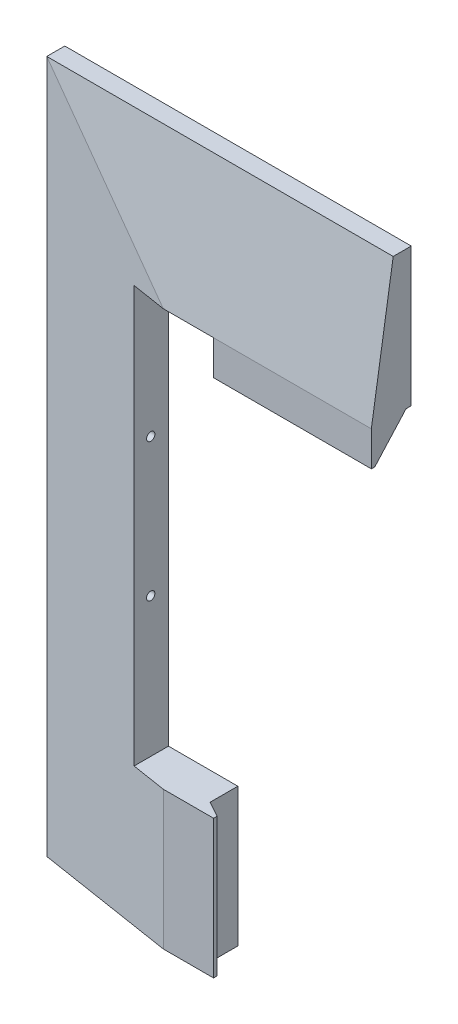
ISO-10303-21;
HEADER;
FILE_DESCRIPTION(('STEP AP214'),'2;1');
FILE_NAME('part.step','',(''),(''),'','','');
FILE_SCHEMA(('AUTOMOTIVE_DESIGN { 1 0 10303 214 1 1 1 1 }'));
ENDSEC;
DATA;
#1=APPLICATION_CONTEXT('core data for automotive mechanical design processes');
#2=APPLICATION_PROTOCOL_DEFINITION('international standard','automotive_design',2000,#1);
#3=PRODUCT_CONTEXT('',#1,'mechanical');
#4=PRODUCT('Part','Part','',(#3));
#5=PRODUCT_RELATED_PRODUCT_CATEGORY('part','',(#4));
#6=PRODUCT_DEFINITION_FORMATION('','',#4);
#7=PRODUCT_DEFINITION_CONTEXT('part definition',#1,'design');
#8=PRODUCT_DEFINITION('design','',#6,#7);
#9=PRODUCT_DEFINITION_SHAPE('','',#8);
#10=(LENGTH_UNIT() NAMED_UNIT(*) SI_UNIT(.MILLI.,.METRE.));
#11=(NAMED_UNIT(*) PLANE_ANGLE_UNIT() SI_UNIT($,.RADIAN.));
#12=(NAMED_UNIT(*) SI_UNIT($,.STERADIAN.) SOLID_ANGLE_UNIT());
#13=UNCERTAINTY_MEASURE_WITH_UNIT(LENGTH_MEASURE(1.E-05),#10,'distance_accuracy_value','');
#14=(GEOMETRIC_REPRESENTATION_CONTEXT(3) GLOBAL_UNCERTAINTY_ASSIGNED_CONTEXT((#13)) GLOBAL_UNIT_ASSIGNED_CONTEXT((#10,
#11,#12)) REPRESENTATION_CONTEXT('',''));
#15=CARTESIAN_POINT('',(0.,0.,0.));
#16=DIRECTION('',(0.,0.,1.));
#17=DIRECTION('',(1.,0.,0.));
#18=AXIS2_PLACEMENT_3D('',#15,#16,#17);
#19=CARTESIAN_POINT('',(18.5428324180509,83.245366469038,5.2));
#20=DIRECTION('',(-1.,0.,0.));
#21=DIRECTION('',(0.,1.,0.));
#22=AXIS2_PLACEMENT_3D('',#19,#20,#21);
#23=PLANE('',#22);
#24=DIRECTION('',(0.,0.,-1.));
#25=VECTOR('',#24,1.);
#26=CARTESIAN_POINT('',(18.5428324180508,243.145366469038,5.2));
#27=LINE('',#26,#25);
#28=CARTESIAN_POINT('',(18.5428324180508,243.145366469038,1.5));
#29=VERTEX_POINT('',#28);
#30=CARTESIAN_POINT('',(18.5428324180508,243.145366469038,0.));
#31=VERTEX_POINT('',#30);
#32=EDGE_CURVE('E475',#29,#31,#27,.T.);
#33=ORIENTED_EDGE('',*,*,#32,.T.);
#34=DIRECTION('',(0.,-1.,0.));
#35=VECTOR('',#34,1.);
#36=CARTESIAN_POINT('',(18.5428324180508,243.145366469038,0.));
#37=LINE('',#36,#35);
#38=CARTESIAN_POINT('',(18.5428324180508,283.045366469038,0.));
#39=VERTEX_POINT('',#38);
#40=EDGE_CURVE('E563',#39,#31,#37,.T.);
#41=ORIENTED_EDGE('',*,*,#40,.F.);
#42=DIRECTION('',(0.,0.,-1.));
#43=VECTOR('',#42,1.);
#44=CARTESIAN_POINT('',(18.5428324180508,283.045366469038,5.2));
#45=LINE('',#44,#43);
#46=CARTESIAN_POINT('',(18.5428324180508,283.045366469038,5.2));
#47=VERTEX_POINT('',#46);
#48=EDGE_CURVE('E479',#47,#39,#45,.T.);
#49=ORIENTED_EDGE('',*,*,#48,.F.);
#50=DIRECTION('',(0.,0.987762965329069,-0.155962573473011));
#51=VECTOR('',#50,1.);
#52=CARTESIAN_POINT('',(18.5428324180508,243.145366469038,11.5));
#53=LINE('',#52,#51);
#54=CARTESIAN_POINT('',(18.5428324180508,243.145366469038,11.5));
#55=VERTEX_POINT('',#54);
#56=EDGE_CURVE('E629',#55,#47,#53,.T.);
#57=ORIENTED_EDGE('',*,*,#56,.F.);
#58=DIRECTION('',(0.,1.,0.));
#59=VECTOR('',#58,1.);
#60=CARTESIAN_POINT('',(18.5428324180508,233.145366469038,11.5));
#61=LINE('',#60,#59);
#62=CARTESIAN_POINT('',(18.5428324180508,233.145366469038,11.5));
#63=VERTEX_POINT('',#62);
#64=EDGE_CURVE('E271',#63,#55,#61,.T.);
#65=ORIENTED_EDGE('',*,*,#64,.F.);
#66=DIRECTION('',(0.,0.,1.));
#67=VECTOR('',#66,1.);
#68=CARTESIAN_POINT('',(18.5428324180508,233.145366469038,10.5));
#69=LINE('',#68,#67);
#70=CARTESIAN_POINT('',(18.5428324180508,233.145366469038,10.5));
#71=VERTEX_POINT('',#70);
#72=EDGE_CURVE('E270',#71,#63,#69,.T.);
#73=ORIENTED_EDGE('',*,*,#72,.F.);
#74=DIRECTION('',(0.,-0.743294146247166,0.66896473162245));
#75=VECTOR('',#74,1.);
#76=CARTESIAN_POINT('',(18.5428324180508,243.145366469038,1.5));
#77=LINE('',#76,#75);
#78=EDGE_CURVE('E252',#29,#71,#77,.T.);
#79=ORIENTED_EDGE('',*,*,#78,.F.);
#80=EDGE_LOOP('',(#33,#41,#49,#57,#65,#73,#79));
#81=FACE_BOUND('',#80,.T.);
#82=ADVANCED_FACE('F60',(#81),#23,.F.);
#83=CARTESIAN_POINT('',(0.,166.490732938076,11.5));
#84=DIRECTION('',(0.,0.,-1.));
#85=DIRECTION('',(-1.,0.,0.));
#86=AXIS2_PLACEMENT_3D('',#83,#84,#85);
#87=PLANE('',#86);
#88=DIRECTION('',(-1.,0.,0.));
#89=VECTOR('',#88,1.);
#90=CARTESIAN_POINT('',(0.,123.145366469038,11.5));
#91=LINE('',#90,#89);
#92=CARTESIAN_POINT('',(-26.9571675819491,123.145366469038,11.5));
#93=VERTEX_POINT('',#92);
#94=CARTESIAN_POINT('',(-41.4571675819491,123.145366469038,11.5));
#95=VERTEX_POINT('',#94);
#96=EDGE_CURVE('E397',#93,#95,#91,.T.);
#97=ORIENTED_EDGE('',*,*,#96,.T.);
#98=CARTESIAN_POINT('',(-41.4571675819491,83.245366469038,11.5));
#99=DIRECTION('',(0.,1.,0.));
#100=VECTOR('',#99,1.);
#101=LINE('',#98,#100);
#102=CARTESIAN_POINT('',(-41.4571675819491,83.245366469038,11.5));
#103=VERTEX_POINT('',#102);
#104=EDGE_CURVE('E625',#103,#95,#101,.T.);
#105=ORIENTED_EDGE('',*,*,#104,.F.);
#106=CARTESIAN_POINT('',(-31.4571675819491,83.245366469038,11.5));
#107=DIRECTION('',(-1.,0.,0.));
#108=VECTOR('',#107,1.);
#109=LINE('',#106,#108);
#110=CARTESIAN_POINT('',(-31.4571675819491,83.245366469038,11.5));
#111=VERTEX_POINT('',#110);
#112=EDGE_CURVE('E461',#111,#103,#109,.T.);
#113=ORIENTED_EDGE('',*,*,#112,.F.);
#114=DIRECTION('',(1.,0.,0.));
#115=VECTOR('',#114,1.);
#116=CARTESIAN_POINT('',(-31.4571675819491,83.245366469038,11.5));
#117=LINE('',#116,#115);
#118=CARTESIAN_POINT('',(-26.9571675819491,83.245366469038,11.5));
#119=VERTEX_POINT('',#118);
#120=EDGE_CURVE('E276',#111,#119,#117,.T.);
#121=ORIENTED_EDGE('',*,*,#120,.T.);
#122=DIRECTION('',(0.,-1.,0.));
#123=VECTOR('',#122,1.);
#124=CARTESIAN_POINT('',(-26.9571675819491,123.145366469038,11.5));
#125=LINE('',#124,#123);
#126=EDGE_CURVE('E289',#93,#119,#125,.T.);
#127=ORIENTED_EDGE('',*,*,#126,.F.);
#128=EDGE_LOOP('',(#97,#105,#113,#121,#127));
#129=FACE_BOUND('',#128,.T.);
#130=ADVANCED_FACE('F535',(#129),#87,.F.);
#131=CARTESIAN_POINT('',(-2.78003921145283,166.490732938076,17.6069150058678));
#132=DIRECTION('',(-0.155962573473011,0.,0.987762965329069));
#133=DIRECTION('',(0.987762965329069,0.,0.155962573473011));
#134=AXIS2_PLACEMENT_3D('',#131,#132,#133);
#135=PLANE('',#134);
#136=DIRECTION('',(0.,1.,0.));
#137=VECTOR('',#136,1.);
#138=CARTESIAN_POINT('',(-51.4571675819492,166.490732938076,9.92105263157894));
#139=LINE('',#138,#137);
#140=CARTESIAN_POINT('',(-51.4571675819492,123.145366469038,9.92105263157894));
#141=VERTEX_POINT('',#140);
#142=CARTESIAN_POINT('',(-51.4571675819492,243.145366469038,9.92105263157894));
#143=VERTEX_POINT('',#142);
#144=EDGE_CURVE('E495',#141,#143,#139,.T.);
#145=ORIENTED_EDGE('',*,*,#144,.T.);
#146=DIRECTION('',(-0.987762965329069,0.,-0.155962573473011));
#147=VECTOR('',#146,1.);
#148=CARTESIAN_POINT('',(-2.78003921145283,243.145366469038,17.6069150058678));
#149=LINE('',#148,#147);
#150=CARTESIAN_POINT('',(-41.4571675819491,243.145366469038,11.5));
#151=VERTEX_POINT('',#150);
#152=EDGE_CURVE('E606',#151,#143,#149,.T.);
#153=ORIENTED_EDGE('',*,*,#152,.F.);
#154=DIRECTION('',(-0.702740385382544,0.702740385382543,-0.110959008218296));
#155=VECTOR('',#154,1.);
#156=CARTESIAN_POINT('',(-41.4571675819491,243.145366469038,11.5));
#157=LINE('',#156,#155);
#158=CARTESIAN_POINT('',(-81.3571675819492,283.045366469038,5.2));
#159=VERTEX_POINT('',#158);
#160=EDGE_CURVE('E575',#151,#159,#157,.T.);
#161=ORIENTED_EDGE('',*,*,#160,.T.);
#162=DIRECTION('',(0.,-1.,0.));
#163=VECTOR('',#162,1.);
#164=CARTESIAN_POINT('',(-81.3571675819492,166.490732938076,5.2));
#165=LINE('',#164,#163);
#166=CARTESIAN_POINT('',(-81.3571675819492,83.245366469038,5.2));
#167=VERTEX_POINT('',#166);
#168=EDGE_CURVE('E506',#167,#159,#165,.F.);
#169=ORIENTED_EDGE('',*,*,#168,.F.);
#170=DIRECTION('',(-0.987762965329069,0.,-0.155962573473011));
#171=VECTOR('',#170,1.);
#172=CARTESIAN_POINT('',(-41.4571675819491,83.245366469038,11.5));
#173=LINE('',#172,#171);
#174=EDGE_CURVE('E571',#103,#167,#173,.T.);
#175=ORIENTED_EDGE('',*,*,#174,.F.);
#176=ORIENTED_EDGE('',*,*,#104,.T.);
#177=DIRECTION('',(0.987762965329069,0.,0.155962573473011));
#178=VECTOR('',#177,1.);
#179=CARTESIAN_POINT('',(-2.78003921145283,123.145366469038,17.6069150058678));
#180=LINE('',#179,#178);
#181=EDGE_CURVE('E640',#141,#95,#180,.T.);
#182=ORIENTED_EDGE('',*,*,#181,.F.);
#183=EDGE_LOOP('',(#145,#153,#161,#169,#175,#176,#182));
#184=FACE_BOUND('',#183,.T.);
#185=ADVANCED_FACE('F553',(#184),#135,.T.);
#186=CARTESIAN_POINT('',(-81.3571675819492,83.245366469038,5.2));
#187=DIRECTION('',(1.,0.,0.));
#188=DIRECTION('',(0.,-1.,0.));
#189=AXIS2_PLACEMENT_3D('',#186,#187,#188);
#190=PLANE('',#189);
#191=DIRECTION('',(0.,1.,0.));
#192=VECTOR('',#191,1.);
#193=CARTESIAN_POINT('',(-81.3571675819492,83.245366469038,0.));
#194=LINE('',#193,#192);
#195=CARTESIAN_POINT('',(-81.3571675819492,83.245366469038,0.));
#196=VERTEX_POINT('',#195);
#197=CARTESIAN_POINT('',(-81.3571675819492,283.045366469038,0.));
#198=VERTEX_POINT('',#197);
#199=EDGE_CURVE('E564',#196,#198,#194,.T.);
#200=ORIENTED_EDGE('',*,*,#199,.F.);
#201=DIRECTION('',(0.,0.,-1.));
#202=VECTOR('',#201,1.);
#203=CARTESIAN_POINT('',(-81.3571675819492,83.245366469038,5.2));
#204=LINE('',#203,#202);
#205=EDGE_CURVE('E496',#167,#196,#204,.T.);
#206=ORIENTED_EDGE('',*,*,#205,.F.);
#207=ORIENTED_EDGE('',*,*,#168,.T.);
#208=DIRECTION('',(0.,0.,-1.));
#209=VECTOR('',#208,1.);
#210=CARTESIAN_POINT('',(-81.3571675819492,283.045366469038,5.2));
#211=LINE('',#210,#209);
#212=EDGE_CURVE('E489',#159,#198,#211,.T.);
#213=ORIENTED_EDGE('',*,*,#212,.T.);
#214=EDGE_LOOP('',(#200,#206,#207,#213));
#215=FACE_BOUND('',#214,.T.);
#216=ADVANCED_FACE('F62',(#215),#190,.F.);
#217=CARTESIAN_POINT('',(-81.3571675819492,283.045366469038,5.2));
#218=DIRECTION('',(0.,-1.,0.));
#219=DIRECTION('',(-1.,0.,0.));
#220=AXIS2_PLACEMENT_3D('',#217,#218,#219);
#221=PLANE('',#220);
#222=DIRECTION('',(1.,0.,0.));
#223=VECTOR('',#222,1.);
#224=CARTESIAN_POINT('',(-81.3571675819492,283.045366469038,0.));
#225=LINE('',#224,#223);
#226=EDGE_CURVE('E556',#198,#39,#225,.T.);
#227=ORIENTED_EDGE('',*,*,#226,.F.);
#228=ORIENTED_EDGE('',*,*,#212,.F.);
#229=DIRECTION('',(1.,0.,0.));
#230=VECTOR('',#229,1.);
#231=CARTESIAN_POINT('',(0.,283.045366469038,5.2));
#232=LINE('',#231,#230);
#233=EDGE_CURVE('E501',#159,#47,#232,.T.);
#234=ORIENTED_EDGE('',*,*,#233,.T.);
#235=ORIENTED_EDGE('',*,*,#48,.T.);
#236=EDGE_LOOP('',(#227,#228,#234,#235));
#237=FACE_BOUND('',#236,.T.);
#238=ADVANCED_FACE('F546',(#237),#221,.F.);
#239=CARTESIAN_POINT('',(-51.4571675819492,243.145366469038,5.2));
#240=DIRECTION('',(0.,1.,0.));
#241=DIRECTION('',(1.,0.,0.));
#242=AXIS2_PLACEMENT_3D('',#239,#240,#241);
#243=PLANE('',#242);
#244=DIRECTION('',(0.,0.,-1.));
#245=VECTOR('',#244,1.);
#246=CARTESIAN_POINT('',(-26.9571675819492,243.145366469038,11.5));
#247=LINE('',#246,#245);
#248=CARTESIAN_POINT('',(-26.9571675819492,243.145366469038,11.5));
#249=VERTEX_POINT('',#248);
#250=CARTESIAN_POINT('',(-26.9571675819492,243.145366469038,1.5));
#251=VERTEX_POINT('',#250);
#252=EDGE_CURVE('E247',#249,#251,#247,.T.);
#253=ORIENTED_EDGE('',*,*,#252,.F.);
#254=DIRECTION('',(1.,0.,0.));
#255=VECTOR('',#254,1.);
#256=CARTESIAN_POINT('',(-41.4571675819491,243.145366469038,11.5));
#257=LINE('',#256,#255);
#258=EDGE_CURVE('E610',#151,#249,#257,.T.);
#259=ORIENTED_EDGE('',*,*,#258,.F.);
#260=ORIENTED_EDGE('',*,*,#152,.T.);
#261=DIRECTION('',(0.,0.,-1.));
#262=VECTOR('',#261,1.);
#263=CARTESIAN_POINT('',(-51.4571675819492,243.145366469038,5.2));
#264=LINE('',#263,#262);
#265=CARTESIAN_POINT('',(-51.4571675819492,243.145366469038,0.));
#266=VERTEX_POINT('',#265);
#267=EDGE_CURVE('E480',#143,#266,#264,.T.);
#268=ORIENTED_EDGE('',*,*,#267,.T.);
#269=DIRECTION('',(-1.,0.,0.));
#270=VECTOR('',#269,1.);
#271=CARTESIAN_POINT('',(-51.4571675819492,243.145366469038,0.));
#272=LINE('',#271,#270);
#273=EDGE_CURVE('E585',#31,#266,#272,.T.);
#274=ORIENTED_EDGE('',*,*,#273,.F.);
#275=ORIENTED_EDGE('',*,*,#32,.F.);
#276=DIRECTION('',(1.,0.,0.));
#277=VECTOR('',#276,1.);
#278=CARTESIAN_POINT('',(-26.9571675819492,243.145366469038,1.5));
#279=LINE('',#278,#277);
#280=EDGE_CURVE('E82',#251,#29,#279,.T.);
#281=ORIENTED_EDGE('',*,*,#280,.F.);
#282=EDGE_LOOP('',(#253,#259,#260,#268,#274,#275,#281));
#283=FACE_BOUND('',#282,.T.);
#284=ADVANCED_FACE('F543',(#283),#243,.F.);
#285=CARTESIAN_POINT('',(-51.4571675819492,123.145366469038,5.2));
#286=DIRECTION('',(-1.,0.,0.));
#287=DIRECTION('',(0.,1.,0.));
#288=AXIS2_PLACEMENT_3D('',#285,#286,#287);
#289=PLANE('',#288);
#290=DIRECTION('',(0.,-1.,0.));
#291=VECTOR('',#290,1.);
#292=CARTESIAN_POINT('',(-51.4571675819492,123.145366469038,0.));
#293=LINE('',#292,#291);
#294=CARTESIAN_POINT('',(-51.4571675819492,123.145366469038,0.));
#295=VERTEX_POINT('',#294);
#296=EDGE_CURVE('E589',#266,#295,#293,.T.);
#297=ORIENTED_EDGE('',*,*,#296,.F.);
#298=ORIENTED_EDGE('',*,*,#267,.F.);
#299=ORIENTED_EDGE('',*,*,#144,.F.);
#300=DIRECTION('',(0.,0.,-1.));
#301=VECTOR('',#300,1.);
#302=CARTESIAN_POINT('',(-51.4571675819492,123.145366469038,5.2));
#303=LINE('',#302,#301);
#304=EDGE_CURVE('E500',#141,#295,#303,.T.);
#305=ORIENTED_EDGE('',*,*,#304,.T.);
#306=EDGE_LOOP('',(#297,#298,#299,#305));
#307=FACE_BOUND('',#306,.T.);
#308=CARTESIAN_POINT('',(-51.4571675819492,163.245366469038,5.12));
#309=DIRECTION('',(-1.,0.,0.));
#310=DIRECTION('',(0.,-1.,0.));
#311=AXIS2_PLACEMENT_3D('',#308,#309,#310);
#312=CIRCLE('',#311,1.2);
#313=CARTESIAN_POINT('',(-51.4571675819492,162.045366469038,5.12));
#314=VERTEX_POINT('',#313);
#315=EDGE_CURVE('E339',#314,#314,#312,.T.);
#316=ORIENTED_EDGE('',*,*,#315,.T.);
#317=EDGE_LOOP('',(#316));
#318=FACE_BOUND('',#317,.T.);
#319=CARTESIAN_POINT('',(-51.4571675819491,203.045366469038,5.12));
#320=DIRECTION('',(-1.,0.,0.));
#321=DIRECTION('',(0.,-1.,0.));
#322=AXIS2_PLACEMENT_3D('',#319,#320,#321);
#323=CIRCLE('',#322,1.2);
#324=CARTESIAN_POINT('',(-51.4571675819491,201.845366469038,5.12));
#325=VERTEX_POINT('',#324);
#326=EDGE_CURVE('E311',#325,#325,#323,.T.);
#327=ORIENTED_EDGE('',*,*,#326,.T.);
#328=EDGE_LOOP('',(#327));
#329=FACE_BOUND('',#328,.T.);
#330=ADVANCED_FACE('F539',(#307,#318,#329),#289,.F.);
#331=CARTESIAN_POINT('',(-51.4571675819492,123.145366469038,5.2));
#332=DIRECTION('',(0.,-1.,0.));
#333=DIRECTION('',(0.,0.,1.));
#334=AXIS2_PLACEMENT_3D('',#331,#332,#333);
#335=PLANE('',#334);
#336=DIRECTION('',(1.,0.,0.));
#337=VECTOR('',#336,1.);
#338=CARTESIAN_POINT('',(-51.4571675819492,123.145366469038,0.));
#339=LINE('',#338,#337);
#340=CARTESIAN_POINT('',(-31.4571675819491,123.145366469038,0.));
#341=VERTEX_POINT('',#340);
#342=EDGE_CURVE('E593',#295,#341,#339,.T.);
#343=ORIENTED_EDGE('',*,*,#342,.F.);
#344=ORIENTED_EDGE('',*,*,#304,.F.);
#345=ORIENTED_EDGE('',*,*,#181,.T.);
#346=ORIENTED_EDGE('',*,*,#96,.F.);
#347=DIRECTION('',(0.,0.,-1.));
#348=VECTOR('',#347,1.);
#349=CARTESIAN_POINT('',(-26.9571675819491,123.145366469038,11.5));
#350=LINE('',#349,#348);
#351=CARTESIAN_POINT('',(-26.9571675819491,123.145366469038,10.5));
#352=VERTEX_POINT('',#351);
#353=EDGE_CURVE('E280',#93,#352,#350,.T.);
#354=ORIENTED_EDGE('',*,*,#353,.T.);
#355=DIRECTION('',(-0.874157276121538,0.,-0.485642931178632));
#356=VECTOR('',#355,1.);
#357=CARTESIAN_POINT('',(-26.9571675819491,123.145366469038,10.5));
#358=LINE('',#357,#356);
#359=CARTESIAN_POINT('',(-31.4571675819491,123.145366469038,7.99999999999999));
#360=VERTEX_POINT('',#359);
#361=EDGE_CURVE('E284',#352,#360,#358,.T.);
#362=ORIENTED_EDGE('',*,*,#361,.T.);
#363=DIRECTION('',(0.,0.,1.));
#364=VECTOR('',#363,1.);
#365=CARTESIAN_POINT('',(-31.4571675819491,123.145366469038,-12.5));
#366=LINE('',#365,#364);
#367=EDGE_CURVE('E300',#341,#360,#366,.T.);
#368=ORIENTED_EDGE('',*,*,#367,.F.);
#369=EDGE_LOOP('',(#343,#344,#345,#346,#354,#362,#368));
#370=FACE_BOUND('',#369,.T.);
#371=ADVANCED_FACE('F530',(#370),#335,.F.);
#372=CARTESIAN_POINT('',(-81.3571675819492,83.245366469038,5.2));
#373=DIRECTION('',(0.,1.,0.));
#374=DIRECTION('',(1.,0.,0.));
#375=AXIS2_PLACEMENT_3D('',#372,#373,#374);
#376=PLANE('',#375);
#377=ORIENTED_EDGE('',*,*,#112,.T.);
#378=ORIENTED_EDGE('',*,*,#174,.T.);
#379=ORIENTED_EDGE('',*,*,#205,.T.);
#380=DIRECTION('',(-1.,0.,0.));
#381=VECTOR('',#380,1.);
#382=CARTESIAN_POINT('',(-81.3571675819492,83.245366469038,0.));
#383=LINE('',#382,#381);
#384=CARTESIAN_POINT('',(-31.4571675819491,83.245366469038,0.));
#385=VERTEX_POINT('',#384);
#386=EDGE_CURVE('E512',#385,#196,#383,.T.);
#387=ORIENTED_EDGE('',*,*,#386,.F.);
#388=DIRECTION('',(0.,0.,1.));
#389=VECTOR('',#388,1.);
#390=CARTESIAN_POINT('',(-31.4571675819491,83.245366469038,-12.5));
#391=LINE('',#390,#389);
#392=CARTESIAN_POINT('',(-31.4571675819491,83.245366469038,7.99999999999999));
#393=VERTEX_POINT('',#392);
#394=EDGE_CURVE('E310',#385,#393,#391,.T.);
#395=ORIENTED_EDGE('',*,*,#394,.T.);
#396=DIRECTION('',(-0.874157276121538,0.,-0.485642931178632));
#397=VECTOR('',#396,1.);
#398=CARTESIAN_POINT('',(-26.9571675819491,83.245366469038,10.5));
#399=LINE('',#398,#397);
#400=CARTESIAN_POINT('',(-26.9571675819491,83.245366469038,10.5));
#401=VERTEX_POINT('',#400);
#402=EDGE_CURVE('E285',#401,#393,#399,.T.);
#403=ORIENTED_EDGE('',*,*,#402,.F.);
#404=DIRECTION('',(0.,0.,-1.));
#405=VECTOR('',#404,1.);
#406=CARTESIAN_POINT('',(-26.9571675819491,83.245366469038,11.5));
#407=LINE('',#406,#405);
#408=EDGE_CURVE('E290',#119,#401,#407,.T.);
#409=ORIENTED_EDGE('',*,*,#408,.F.);
#410=ORIENTED_EDGE('',*,*,#120,.F.);
#411=EDGE_LOOP('',(#377,#378,#379,#387,#395,#403,#409,#410));
#412=FACE_BOUND('',#411,.T.);
#413=ADVANCED_FACE('F519',(#412),#376,.F.);
#414=CARTESIAN_POINT('',(0.,166.490732938076,0.));
#415=DIRECTION('',(0.,0.,1.));
#416=DIRECTION('',(1.,0.,0.));
#417=AXIS2_PLACEMENT_3D('',#414,#415,#416);
#418=PLANE('',#417);
#419=ORIENTED_EDGE('',*,*,#386,.T.);
#420=ORIENTED_EDGE('',*,*,#199,.T.);
#421=ORIENTED_EDGE('',*,*,#226,.T.);
#422=ORIENTED_EDGE('',*,*,#40,.T.);
#423=ORIENTED_EDGE('',*,*,#273,.T.);
#424=ORIENTED_EDGE('',*,*,#296,.T.);
#425=ORIENTED_EDGE('',*,*,#342,.T.);
#426=DIRECTION('',(0.,1.,0.));
#427=VECTOR('',#426,1.);
#428=CARTESIAN_POINT('',(-31.4571675819491,166.490732938076,0.));
#429=LINE('',#428,#427);
#430=EDGE_CURVE('E12',#385,#341,#429,.T.);
#431=ORIENTED_EDGE('',*,*,#430,.F.);
#432=EDGE_LOOP('',(#419,#420,#421,#422,#423,#424,#425,#431));
#433=FACE_BOUND('',#432,.T.);
#434=ADVANCED_FACE('F529',(#433),#418,.F.);
#435=CARTESIAN_POINT('',(0.,170.126926726667,23.0292273277428));
#436=DIRECTION('',(0.,0.155962573473011,0.987762965329069));
#437=DIRECTION('',(0.,0.987762965329069,-0.155962573473011));
#438=AXIS2_PLACEMENT_3D('',#435,#436,#437);
#439=PLANE('',#438);
#440=ORIENTED_EDGE('',*,*,#160,.F.);
#441=ORIENTED_EDGE('',*,*,#258,.T.);
#442=DIRECTION('',(1.,0.,0.));
#443=VECTOR('',#442,1.);
#444=CARTESIAN_POINT('',(-26.9571675819492,243.145366469038,11.5));
#445=LINE('',#444,#443);
#446=EDGE_CURVE('E262',#249,#55,#445,.T.);
#447=ORIENTED_EDGE('',*,*,#446,.T.);
#448=ORIENTED_EDGE('',*,*,#56,.T.);
#449=ORIENTED_EDGE('',*,*,#233,.F.);
#450=EDGE_LOOP('',(#440,#441,#447,#448,#449));
#451=FACE_BOUND('',#450,.T.);
#452=ADVANCED_FACE('F623',(#451),#439,.T.);
#453=CARTESIAN_POINT('',(-55.2571675819492,163.245366469038,5.12));
#454=DIRECTION('',(1.,0.,0.));
#455=DIRECTION('',(0.,-1.,0.));
#456=AXIS2_PLACEMENT_3D('',#453,#454,#455);
#457=PLANE('',#456);
#458=CARTESIAN_POINT('',(-55.2571675819492,163.245366469038,5.12));
#459=DIRECTION('',(-1.,0.,0.));
#460=DIRECTION('',(0.,-1.,0.));
#461=AXIS2_PLACEMENT_3D('',#458,#459,#460);
#462=CIRCLE('',#461,1.2);
#463=CARTESIAN_POINT('',(-55.2571675819492,162.045366469038,5.12));
#464=VERTEX_POINT('',#463);
#465=EDGE_CURVE('E340',#464,#464,#462,.T.);
#466=ORIENTED_EDGE('',*,*,#465,.F.);
#467=EDGE_LOOP('',(#466));
#468=FACE_BOUND('',#467,.T.);
#469=DIRECTION('',(0.,-0.5,-0.866025403784438));
#470=VECTOR('',#469,1.);
#471=CARTESIAN_POINT('',(-55.2571675819492,160.820495338442,5.12));
#472=LINE('',#471,#470);
#473=CARTESIAN_POINT('',(-55.2571675819492,162.03293090374,7.22));
#474=VERTEX_POINT('',#473);
#475=CARTESIAN_POINT('',(-55.2571675819492,160.820495338442,5.12));
#476=VERTEX_POINT('',#475);
#477=EDGE_CURVE('E636',#474,#476,#472,.T.);
#478=ORIENTED_EDGE('',*,*,#477,.F.);
#479=DIRECTION('',(0.,-1.,0.));
#480=VECTOR('',#479,1.);
#481=CARTESIAN_POINT('',(-55.2571675819492,162.03293090374,7.22));
#482=LINE('',#481,#480);
#483=CARTESIAN_POINT('',(-55.2571675819492,164.457802034336,7.22));
#484=VERTEX_POINT('',#483);
#485=EDGE_CURVE('E344',#484,#474,#482,.T.);
#486=ORIENTED_EDGE('',*,*,#485,.F.);
#487=DIRECTION('',(0.,-0.5,0.866025403784439));
#488=VECTOR('',#487,1.);
#489=CARTESIAN_POINT('',(-55.2571675819492,164.457802034336,7.22));
#490=LINE('',#489,#488);
#491=CARTESIAN_POINT('',(-55.2571675819492,165.670237599634,5.12));
#492=VERTEX_POINT('',#491);
#493=EDGE_CURVE('E351',#492,#484,#490,.T.);
#494=ORIENTED_EDGE('',*,*,#493,.F.);
#495=DIRECTION('',(0.,0.5,0.866025403784439));
#496=VECTOR('',#495,1.);
#497=CARTESIAN_POINT('',(-55.2571675819492,165.670237599634,5.12));
#498=LINE('',#497,#496);
#499=CARTESIAN_POINT('',(-55.2571675819492,164.457802034336,3.02));
#500=VERTEX_POINT('',#499);
#501=EDGE_CURVE('E355',#500,#492,#498,.T.);
#502=ORIENTED_EDGE('',*,*,#501,.F.);
#503=DIRECTION('',(0.,1.,0.));
#504=VECTOR('',#503,1.);
#505=CARTESIAN_POINT('',(-55.2571675819492,164.457802034336,3.02));
#506=LINE('',#505,#504);
#507=CARTESIAN_POINT('',(-55.2571675819492,162.03293090374,3.02));
#508=VERTEX_POINT('',#507);
#509=EDGE_CURVE('E359',#508,#500,#506,.T.);
#510=ORIENTED_EDGE('',*,*,#509,.F.);
#511=DIRECTION('',(0.,0.5,-0.866025403784439));
#512=VECTOR('',#511,1.);
#513=CARTESIAN_POINT('',(-55.2571675819492,162.03293090374,3.02));
#514=LINE('',#513,#512);
#515=EDGE_CURVE('E363',#476,#508,#514,.T.);
#516=ORIENTED_EDGE('',*,*,#515,.F.);
#517=EDGE_LOOP('',(#478,#486,#494,#502,#510,#516));
#518=FACE_BOUND('',#517,.T.);
#519=ADVANCED_FACE('F680',(#468,#518),#457,.F.);
#520=CARTESIAN_POINT('',(-55.2571675819492,163.245366469038,5.12));
#521=DIRECTION('',(1.,0.,0.));
#522=DIRECTION('',(0.,-1.,0.));
#523=AXIS2_PLACEMENT_3D('',#520,#521,#522);
#524=CYLINDRICAL_SURFACE('',#523,1.2);
#525=ORIENTED_EDGE('',*,*,#465,.T.);
#526=EDGE_LOOP('',(#525));
#527=FACE_BOUND('',#526,.T.);
#528=ORIENTED_EDGE('',*,*,#315,.F.);
#529=EDGE_LOOP('',(#528));
#530=FACE_BOUND('',#529,.T.);
#531=ADVANCED_FACE('F789',(#527,#530),#524,.F.);
#532=CARTESIAN_POINT('',(-57.0571675819492,166.490732938076,0.));
#533=DIRECTION('',(1.,0.,0.));
#534=DIRECTION('',(0.,0.,-1.));
#535=AXIS2_PLACEMENT_3D('',#532,#533,#534);
#536=PLANE('',#535);
#537=DIRECTION('',(0.,-0.5,0.866025403784439));
#538=VECTOR('',#537,1.);
#539=CARTESIAN_POINT('',(-57.0571675819492,162.03293090374,3.02));
#540=LINE('',#539,#538);
#541=CARTESIAN_POINT('',(-57.0571675819492,162.03293090374,3.02));
#542=VERTEX_POINT('',#541);
#543=CARTESIAN_POINT('',(-57.0571675819492,160.820495338442,5.12));
#544=VERTEX_POINT('',#543);
#545=EDGE_CURVE('E373',#542,#544,#540,.T.);
#546=ORIENTED_EDGE('',*,*,#545,.F.);
#547=DIRECTION('',(0.,-1.,0.));
#548=VECTOR('',#547,1.);
#549=CARTESIAN_POINT('',(-57.0571675819492,164.457802034336,3.02));
#550=LINE('',#549,#548);
#551=CARTESIAN_POINT('',(-57.0571675819492,164.457802034336,3.02));
#552=VERTEX_POINT('',#551);
#553=EDGE_CURVE('E415',#552,#542,#550,.T.);
#554=ORIENTED_EDGE('',*,*,#553,.F.);
#555=DIRECTION('',(0.,-0.5,-0.866025403784439));
#556=VECTOR('',#555,1.);
#557=CARTESIAN_POINT('',(-57.0571675819492,165.670237599634,5.12));
#558=LINE('',#557,#556);
#559=CARTESIAN_POINT('',(-57.0571675819492,165.670237599634,5.12));
#560=VERTEX_POINT('',#559);
#561=EDGE_CURVE('E433',#560,#552,#558,.T.);
#562=ORIENTED_EDGE('',*,*,#561,.F.);
#563=DIRECTION('',(0.,0.5,-0.866025403784439));
#564=VECTOR('',#563,1.);
#565=CARTESIAN_POINT('',(-57.0571675819492,164.457802034336,7.22));
#566=LINE('',#565,#564);
#567=CARTESIAN_POINT('',(-57.0571675819492,164.457802034336,7.22));
#568=VERTEX_POINT('',#567);
#569=EDGE_CURVE('E437',#568,#560,#566,.T.);
#570=ORIENTED_EDGE('',*,*,#569,.F.);
#571=DIRECTION('',(0.,1.,0.));
#572=VECTOR('',#571,1.);
#573=CARTESIAN_POINT('',(-57.0571675819492,162.03293090374,7.22));
#574=LINE('',#573,#572);
#575=CARTESIAN_POINT('',(-57.0571675819492,162.03293090374,7.22));
#576=VERTEX_POINT('',#575);
#577=EDGE_CURVE('E441',#576,#568,#574,.T.);
#578=ORIENTED_EDGE('',*,*,#577,.F.);
#579=DIRECTION('',(0.,0.5,0.866025403784438));
#580=VECTOR('',#579,1.);
#581=CARTESIAN_POINT('',(-57.0571675819492,160.820495338442,5.12));
#582=LINE('',#581,#580);
#583=EDGE_CURVE('E445',#544,#576,#582,.T.);
#584=ORIENTED_EDGE('',*,*,#583,.F.);
#585=EDGE_LOOP('',(#546,#554,#562,#570,#578,#584));
#586=FACE_BOUND('',#585,.T.);
#587=ADVANCED_FACE('F676',(#586),#536,.T.);
#588=CARTESIAN_POINT('',(-57.0571675819492,160.820495338442,5.12));
#589=DIRECTION('',(0.,-0.866025403784438,0.5));
#590=DIRECTION('',(0.,0.5,0.866025403784438));
#591=AXIS2_PLACEMENT_3D('',#588,#589,#590);
#592=PLANE('',#591);
#593=ORIENTED_EDGE('',*,*,#477,.T.);
#594=DIRECTION('',(1.,0.,0.));
#595=VECTOR('',#594,1.);
#596=CARTESIAN_POINT('',(-57.0571675819492,160.820495338442,5.12));
#597=LINE('',#596,#595);
#598=EDGE_CURVE('E412',#544,#476,#597,.T.);
#599=ORIENTED_EDGE('',*,*,#598,.F.);
#600=ORIENTED_EDGE('',*,*,#583,.T.);
#601=DIRECTION('',(1.,0.,0.));
#602=VECTOR('',#601,1.);
#603=CARTESIAN_POINT('',(-57.0571675819492,162.03293090374,7.22));
#604=LINE('',#603,#602);
#605=EDGE_CURVE('E416',#576,#474,#604,.T.);
#606=ORIENTED_EDGE('',*,*,#605,.T.);
#607=EDGE_LOOP('',(#593,#599,#600,#606));
#608=FACE_BOUND('',#607,.T.);
#609=ADVANCED_FACE('F812',(#608),#592,.F.);
#610=CARTESIAN_POINT('',(-57.0571675819492,162.03293090374,7.22));
#611=DIRECTION('',(0.,0.,1.));
#612=DIRECTION('',(1.,0.,0.));
#613=AXIS2_PLACEMENT_3D('',#610,#611,#612);
#614=PLANE('',#613);
#615=ORIENTED_EDGE('',*,*,#485,.T.);
#616=ORIENTED_EDGE('',*,*,#605,.F.);
#617=ORIENTED_EDGE('',*,*,#577,.T.);
#618=DIRECTION('',(1.,0.,0.));
#619=VECTOR('',#618,1.);
#620=CARTESIAN_POINT('',(-57.0571675819492,164.457802034336,7.22));
#621=LINE('',#620,#619);
#622=EDGE_CURVE('E419',#568,#484,#621,.T.);
#623=ORIENTED_EDGE('',*,*,#622,.T.);
#624=EDGE_LOOP('',(#615,#616,#617,#623));
#625=FACE_BOUND('',#624,.T.);
#626=ADVANCED_FACE('F824',(#625),#614,.F.);
#627=CARTESIAN_POINT('',(-57.0571675819492,164.457802034336,7.22));
#628=DIRECTION('',(0.,0.866025403784438,0.5));
#629=DIRECTION('',(0.,0.5,-0.866025403784439));
#630=AXIS2_PLACEMENT_3D('',#627,#628,#629);
#631=PLANE('',#630);
#632=ORIENTED_EDGE('',*,*,#493,.T.);
#633=ORIENTED_EDGE('',*,*,#622,.F.);
#634=ORIENTED_EDGE('',*,*,#569,.T.);
#635=DIRECTION('',(1.,0.,0.));
#636=VECTOR('',#635,1.);
#637=CARTESIAN_POINT('',(-57.0571675819492,165.670237599634,5.12));
#638=LINE('',#637,#636);
#639=EDGE_CURVE('E422',#560,#492,#638,.T.);
#640=ORIENTED_EDGE('',*,*,#639,.T.);
#641=EDGE_LOOP('',(#632,#633,#634,#640));
#642=FACE_BOUND('',#641,.T.);
#643=ADVANCED_FACE('F836',(#642),#631,.F.);
#644=CARTESIAN_POINT('',(-57.0571675819492,165.670237599634,5.12));
#645=DIRECTION('',(0.,0.866025403784439,-0.5));
#646=DIRECTION('',(0.,-0.5,-0.866025403784439));
#647=AXIS2_PLACEMENT_3D('',#644,#645,#646);
#648=PLANE('',#647);
#649=ORIENTED_EDGE('',*,*,#501,.T.);
#650=ORIENTED_EDGE('',*,*,#639,.F.);
#651=ORIENTED_EDGE('',*,*,#561,.T.);
#652=DIRECTION('',(1.,0.,0.));
#653=VECTOR('',#652,1.);
#654=CARTESIAN_POINT('',(-57.0571675819492,164.457802034336,3.02));
#655=LINE('',#654,#653);
#656=EDGE_CURVE('E425',#552,#500,#655,.T.);
#657=ORIENTED_EDGE('',*,*,#656,.T.);
#658=EDGE_LOOP('',(#649,#650,#651,#657));
#659=FACE_BOUND('',#658,.T.);
#660=ADVANCED_FACE('F847',(#659),#648,.F.);
#661=CARTESIAN_POINT('',(-57.0571675819492,164.457802034336,3.02));
#662=DIRECTION('',(0.,0.,-1.));
#663=DIRECTION('',(0.,-1.,0.));
#664=AXIS2_PLACEMENT_3D('',#661,#662,#663);
#665=PLANE('',#664);
#666=ORIENTED_EDGE('',*,*,#509,.T.);
#667=ORIENTED_EDGE('',*,*,#656,.F.);
#668=ORIENTED_EDGE('',*,*,#553,.T.);
#669=DIRECTION('',(1.,0.,0.));
#670=VECTOR('',#669,1.);
#671=CARTESIAN_POINT('',(-57.0571675819492,162.03293090374,3.02));
#672=LINE('',#671,#670);
#673=EDGE_CURVE('E367',#542,#508,#672,.T.);
#674=ORIENTED_EDGE('',*,*,#673,.T.);
#675=EDGE_LOOP('',(#666,#667,#668,#674));
#676=FACE_BOUND('',#675,.T.);
#677=ADVANCED_FACE('F858',(#676),#665,.F.);
#678=CARTESIAN_POINT('',(-57.0571675819492,162.03293090374,3.02));
#679=DIRECTION('',(0.,-0.866025403784439,-0.5));
#680=DIRECTION('',(0.,-0.5,0.866025403784439));
#681=AXIS2_PLACEMENT_3D('',#678,#679,#680);
#682=PLANE('',#681);
#683=ORIENTED_EDGE('',*,*,#515,.T.);
#684=ORIENTED_EDGE('',*,*,#673,.F.);
#685=ORIENTED_EDGE('',*,*,#545,.T.);
#686=ORIENTED_EDGE('',*,*,#598,.T.);
#687=EDGE_LOOP('',(#683,#684,#685,#686));
#688=FACE_BOUND('',#687,.T.);
#689=ADVANCED_FACE('F868',(#688),#682,.F.);
#690=CARTESIAN_POINT('',(-55.2571675819491,203.045366469038,5.12));
#691=DIRECTION('',(1.,0.,0.));
#692=DIRECTION('',(0.,-1.,0.));
#693=AXIS2_PLACEMENT_3D('',#690,#691,#692);
#694=PLANE('',#693);
#695=CARTESIAN_POINT('',(-55.2571675819491,203.045366469038,5.12));
#696=DIRECTION('',(-1.,0.,0.));
#697=DIRECTION('',(0.,-1.,0.));
#698=AXIS2_PLACEMENT_3D('',#695,#696,#697);
#699=CIRCLE('',#698,1.2);
#700=CARTESIAN_POINT('',(-55.2571675819491,201.845366469038,5.12));
#701=VERTEX_POINT('',#700);
#702=EDGE_CURVE('E316',#701,#701,#699,.T.);
#703=ORIENTED_EDGE('',*,*,#702,.F.);
#704=EDGE_LOOP('',(#703));
#705=FACE_BOUND('',#704,.T.);
#706=DIRECTION('',(0.,-0.5,-0.866025403784439));
#707=VECTOR('',#706,1.);
#708=CARTESIAN_POINT('',(-55.2571675819491,200.620495338442,5.11999999999999));
#709=LINE('',#708,#707);
#710=CARTESIAN_POINT('',(-55.2571675819491,201.83293090374,7.22));
#711=VERTEX_POINT('',#710);
#712=CARTESIAN_POINT('',(-55.2571675819491,200.620495338442,5.11999999999999));
#713=VERTEX_POINT('',#712);
#714=EDGE_CURVE('E70',#711,#713,#709,.T.);
#715=ORIENTED_EDGE('',*,*,#714,.F.);
#716=DIRECTION('',(0.,-1.,0.));
#717=VECTOR('',#716,1.);
#718=CARTESIAN_POINT('',(-55.2571675819491,201.83293090374,7.22));
#719=LINE('',#718,#717);
#720=CARTESIAN_POINT('',(-55.2571675819492,204.257802034336,7.22));
#721=VERTEX_POINT('',#720);
#722=EDGE_CURVE('E315',#721,#711,#719,.T.);
#723=ORIENTED_EDGE('',*,*,#722,.F.);
#724=DIRECTION('',(0.,-0.5,0.866025403784439));
#725=VECTOR('',#724,1.);
#726=CARTESIAN_POINT('',(-55.2571675819492,204.257802034336,7.22));
#727=LINE('',#726,#725);
#728=CARTESIAN_POINT('',(-55.2571675819492,205.470237599634,5.11999999999999));
#729=VERTEX_POINT('',#728);
#730=EDGE_CURVE('E323',#729,#721,#727,.T.);
#731=ORIENTED_EDGE('',*,*,#730,.F.);
#732=DIRECTION('',(0.,0.500000000000002,0.866025403784438));
#733=VECTOR('',#732,1.);
#734=CARTESIAN_POINT('',(-55.2571675819492,205.470237599634,5.11999999999999));
#735=LINE('',#734,#733);
#736=CARTESIAN_POINT('',(-55.2571675819492,204.257802034336,3.02));
#737=VERTEX_POINT('',#736);
#738=EDGE_CURVE('E327',#737,#729,#735,.T.);
#739=ORIENTED_EDGE('',*,*,#738,.F.);
#740=DIRECTION('',(0.,1.,0.));
#741=VECTOR('',#740,1.);
#742=CARTESIAN_POINT('',(-55.2571675819492,204.257802034336,3.02));
#743=LINE('',#742,#741);
#744=CARTESIAN_POINT('',(-55.2571675819491,201.83293090374,3.02));
#745=VERTEX_POINT('',#744);
#746=EDGE_CURVE('E331',#745,#737,#743,.T.);
#747=ORIENTED_EDGE('',*,*,#746,.F.);
#748=DIRECTION('',(0.,0.500000000000002,-0.866025403784438));
#749=VECTOR('',#748,1.);
#750=CARTESIAN_POINT('',(-55.2571675819491,201.83293090374,3.02));
#751=LINE('',#750,#749);
#752=EDGE_CURVE('E335',#713,#745,#751,.T.);
#753=ORIENTED_EDGE('',*,*,#752,.F.);
#754=EDGE_LOOP('',(#715,#723,#731,#739,#747,#753));
#755=FACE_BOUND('',#754,.T.);
#756=ADVANCED_FACE('F877',(#705,#755),#694,.F.);
#757=CARTESIAN_POINT('',(-55.2571675819491,203.045366469038,5.12));
#758=DIRECTION('',(1.,0.,0.));
#759=DIRECTION('',(0.,-1.,0.));
#760=AXIS2_PLACEMENT_3D('',#757,#758,#759);
#761=CYLINDRICAL_SURFACE('',#760,1.2);
#762=ORIENTED_EDGE('',*,*,#702,.T.);
#763=EDGE_LOOP('',(#762));
#764=FACE_BOUND('',#763,.T.);
#765=ORIENTED_EDGE('',*,*,#326,.F.);
#766=EDGE_LOOP('',(#765));
#767=FACE_BOUND('',#766,.T.);
#768=ADVANCED_FACE('F888',(#764,#767),#761,.F.);
#769=CARTESIAN_POINT('',(-57.0571675819491,166.490732938076,0.));
#770=DIRECTION('',(1.,0.,0.));
#771=DIRECTION('',(0.,0.,-1.));
#772=AXIS2_PLACEMENT_3D('',#769,#770,#771);
#773=PLANE('',#772);
#774=DIRECTION('',(0.,-0.500000000000002,0.866025403784438));
#775=VECTOR('',#774,1.);
#776=CARTESIAN_POINT('',(-57.0571675819492,201.83293090374,3.02));
#777=LINE('',#776,#775);
#778=CARTESIAN_POINT('',(-57.0571675819492,201.83293090374,3.02));
#779=VERTEX_POINT('',#778);
#780=CARTESIAN_POINT('',(-57.0571675819492,200.620495338442,5.11999999999999));
#781=VERTEX_POINT('',#780);
#782=EDGE_CURVE('E368',#779,#781,#777,.T.);
#783=ORIENTED_EDGE('',*,*,#782,.F.);
#784=DIRECTION('',(0.,-1.,0.));
#785=VECTOR('',#784,1.);
#786=CARTESIAN_POINT('',(-57.0571675819492,204.257802034336,3.02));
#787=LINE('',#786,#785);
#788=CARTESIAN_POINT('',(-57.0571675819492,204.257802034336,3.02));
#789=VERTEX_POINT('',#788);
#790=EDGE_CURVE('E389',#789,#779,#787,.T.);
#791=ORIENTED_EDGE('',*,*,#790,.F.);
#792=DIRECTION('',(0.,-0.500000000000002,-0.866025403784438));
#793=VECTOR('',#792,1.);
#794=CARTESIAN_POINT('',(-57.0571675819492,205.470237599634,5.11999999999999));
#795=LINE('',#794,#793);
#796=CARTESIAN_POINT('',(-57.0571675819492,205.470237599634,5.11999999999999));
#797=VERTEX_POINT('',#796);
#798=EDGE_CURVE('E385',#797,#789,#795,.T.);
#799=ORIENTED_EDGE('',*,*,#798,.F.);
#800=DIRECTION('',(0.,0.5,-0.866025403784439));
#801=VECTOR('',#800,1.);
#802=CARTESIAN_POINT('',(-57.0571675819492,204.257802034336,7.22));
#803=LINE('',#802,#801);
#804=CARTESIAN_POINT('',(-57.0571675819492,204.257802034336,7.22));
#805=VERTEX_POINT('',#804);
#806=EDGE_CURVE('E381',#805,#797,#803,.T.);
#807=ORIENTED_EDGE('',*,*,#806,.F.);
#808=DIRECTION('',(0.,1.,0.));
#809=VECTOR('',#808,1.);
#810=CARTESIAN_POINT('',(-57.0571675819492,201.83293090374,7.22));
#811=LINE('',#810,#809);
#812=CARTESIAN_POINT('',(-57.0571675819492,201.83293090374,7.22));
#813=VERTEX_POINT('',#812);
#814=EDGE_CURVE('E377',#813,#805,#811,.T.);
#815=ORIENTED_EDGE('',*,*,#814,.F.);
#816=DIRECTION('',(0.,0.5,0.866025403784439));
#817=VECTOR('',#816,1.);
#818=CARTESIAN_POINT('',(-57.0571675819492,200.620495338442,5.11999999999999));
#819=LINE('',#818,#817);
#820=EDGE_CURVE('E372',#781,#813,#819,.T.);
#821=ORIENTED_EDGE('',*,*,#820,.F.);
#822=EDGE_LOOP('',(#783,#791,#799,#807,#815,#821));
#823=FACE_BOUND('',#822,.T.);
#824=ADVANCED_FACE('F899',(#823),#773,.T.);
#825=CARTESIAN_POINT('',(-57.0571675819492,200.620495338442,5.11999999999999));
#826=DIRECTION('',(0.,-0.866025403784439,0.5));
#827=DIRECTION('',(0.,0.5,0.866025403784439));
#828=AXIS2_PLACEMENT_3D('',#825,#826,#827);
#829=PLANE('',#828);
#830=ORIENTED_EDGE('',*,*,#714,.T.);
#831=DIRECTION('',(1.,0.,0.));
#832=VECTOR('',#831,1.);
#833=CARTESIAN_POINT('',(-57.0571675819492,200.620495338442,5.11999999999999));
#834=LINE('',#833,#832);
#835=EDGE_CURVE('E393',#781,#713,#834,.T.);
#836=ORIENTED_EDGE('',*,*,#835,.F.);
#837=ORIENTED_EDGE('',*,*,#820,.T.);
#838=DIRECTION('',(1.,0.,0.));
#839=VECTOR('',#838,1.);
#840=CARTESIAN_POINT('',(-57.0571675819492,201.83293090374,7.22));
#841=LINE('',#840,#839);
#842=EDGE_CURVE('E407',#813,#711,#841,.T.);
#843=ORIENTED_EDGE('',*,*,#842,.T.);
#844=EDGE_LOOP('',(#830,#836,#837,#843));
#845=FACE_BOUND('',#844,.T.);
#846=ADVANCED_FACE('F909',(#845),#829,.F.);
#847=CARTESIAN_POINT('',(-57.0571675819492,201.83293090374,7.22));
#848=DIRECTION('',(0.,0.,1.));
#849=DIRECTION('',(0.,1.,0.));
#850=AXIS2_PLACEMENT_3D('',#847,#848,#849);
#851=PLANE('',#850);
#852=ORIENTED_EDGE('',*,*,#722,.T.);
#853=ORIENTED_EDGE('',*,*,#842,.F.);
#854=ORIENTED_EDGE('',*,*,#814,.T.);
#855=DIRECTION('',(1.,0.,0.));
#856=VECTOR('',#855,1.);
#857=CARTESIAN_POINT('',(-57.0571675819492,204.257802034336,7.22));
#858=LINE('',#857,#856);
#859=EDGE_CURVE('E404',#805,#721,#858,.T.);
#860=ORIENTED_EDGE('',*,*,#859,.T.);
#861=EDGE_LOOP('',(#852,#853,#854,#860));
#862=FACE_BOUND('',#861,.T.);
#863=ADVANCED_FACE('F920',(#862),#851,.F.);
#864=CARTESIAN_POINT('',(-57.0571675819492,204.257802034336,7.22));
#865=DIRECTION('',(0.,0.866025403784439,0.5));
#866=DIRECTION('',(0.,0.5,-0.866025403784439));
#867=AXIS2_PLACEMENT_3D('',#864,#865,#866);
#868=PLANE('',#867);
#869=ORIENTED_EDGE('',*,*,#730,.T.);
#870=ORIENTED_EDGE('',*,*,#859,.F.);
#871=ORIENTED_EDGE('',*,*,#806,.T.);
#872=DIRECTION('',(1.,0.,0.));
#873=VECTOR('',#872,1.);
#874=CARTESIAN_POINT('',(-57.0571675819492,205.470237599634,5.11999999999999));
#875=LINE('',#874,#873);
#876=EDGE_CURVE('E401',#797,#729,#875,.T.);
#877=ORIENTED_EDGE('',*,*,#876,.T.);
#878=EDGE_LOOP('',(#869,#870,#871,#877));
#879=FACE_BOUND('',#878,.T.);
#880=ADVANCED_FACE('F931',(#879),#868,.F.);
#881=CARTESIAN_POINT('',(-57.0571675819492,205.470237599634,5.11999999999999));
#882=DIRECTION('',(0.,0.866025403784438,-0.500000000000002));
#883=DIRECTION('',(0.,-0.500000000000002,-0.866025403784438));
#884=AXIS2_PLACEMENT_3D('',#881,#882,#883);
#885=PLANE('',#884);
#886=ORIENTED_EDGE('',*,*,#738,.T.);
#887=ORIENTED_EDGE('',*,*,#876,.F.);
#888=ORIENTED_EDGE('',*,*,#798,.T.);
#889=DIRECTION('',(1.,0.,0.));
#890=VECTOR('',#889,1.);
#891=CARTESIAN_POINT('',(-57.0571675819492,204.257802034336,3.02));
#892=LINE('',#891,#890);
#893=EDGE_CURVE('E398',#789,#737,#892,.T.);
#894=ORIENTED_EDGE('',*,*,#893,.T.);
#895=EDGE_LOOP('',(#886,#887,#888,#894));
#896=FACE_BOUND('',#895,.T.);
#897=ADVANCED_FACE('F942',(#896),#885,.F.);
#898=CARTESIAN_POINT('',(-57.0571675819492,204.257802034336,3.02));
#899=DIRECTION('',(0.,0.,-1.));
#900=DIRECTION('',(0.,-1.,0.));
#901=AXIS2_PLACEMENT_3D('',#898,#899,#900);
#902=PLANE('',#901);
#903=ORIENTED_EDGE('',*,*,#746,.T.);
#904=ORIENTED_EDGE('',*,*,#893,.F.);
#905=ORIENTED_EDGE('',*,*,#790,.T.);
#906=DIRECTION('',(1.,0.,0.));
#907=VECTOR('',#906,1.);
#908=CARTESIAN_POINT('',(-57.0571675819492,201.83293090374,3.02));
#909=LINE('',#908,#907);
#910=EDGE_CURVE('E394',#779,#745,#909,.T.);
#911=ORIENTED_EDGE('',*,*,#910,.T.);
#912=EDGE_LOOP('',(#903,#904,#905,#911));
#913=FACE_BOUND('',#912,.T.);
#914=ADVANCED_FACE('F953',(#913),#902,.F.);
#915=CARTESIAN_POINT('',(-57.0571675819492,201.83293090374,3.02));
#916=DIRECTION('',(0.,-0.866025403784438,-0.500000000000002));
#917=DIRECTION('',(0.,-0.500000000000002,0.866025403784438));
#918=AXIS2_PLACEMENT_3D('',#915,#916,#917);
#919=PLANE('',#918);
#920=ORIENTED_EDGE('',*,*,#752,.T.);
#921=ORIENTED_EDGE('',*,*,#910,.F.);
#922=ORIENTED_EDGE('',*,*,#782,.T.);
#923=ORIENTED_EDGE('',*,*,#835,.T.);
#924=EDGE_LOOP('',(#920,#921,#922,#923));
#925=FACE_BOUND('',#924,.T.);
#926=ADVANCED_FACE('F963',(#925),#919,.F.);
#927=CARTESIAN_POINT('',(-31.4571675819491,83.245366469038,-12.5));
#928=DIRECTION('',(-1.,0.,0.));
#929=DIRECTION('',(0.,1.,0.));
#930=AXIS2_PLACEMENT_3D('',#927,#928,#929);
#931=PLANE('',#930);
#932=ORIENTED_EDGE('',*,*,#394,.F.);
#933=ORIENTED_EDGE('',*,*,#430,.T.);
#934=ORIENTED_EDGE('',*,*,#367,.T.);
#935=DIRECTION('',(0.,-1.,0.));
#936=VECTOR('',#935,1.);
#937=CARTESIAN_POINT('',(-31.4571675819491,123.145366469038,8.));
#938=LINE('',#937,#936);
#939=EDGE_CURVE('E297',#360,#393,#938,.T.);
#940=ORIENTED_EDGE('',*,*,#939,.T.);
#941=EDGE_LOOP('',(#932,#933,#934,#940));
#942=FACE_BOUND('',#941,.T.);
#943=ADVANCED_FACE('F973',(#942),#931,.F.);
#944=CARTESIAN_POINT('',(-26.9571675819491,123.145366469038,10.5));
#945=DIRECTION('',(0.485642931178632,0.,-0.874157276121538));
#946=DIRECTION('',(-0.874157276121538,0.,-0.485642931178632));
#947=AXIS2_PLACEMENT_3D('',#944,#945,#946);
#948=PLANE('',#947);
#949=ORIENTED_EDGE('',*,*,#402,.T.);
#950=ORIENTED_EDGE('',*,*,#939,.F.);
#951=ORIENTED_EDGE('',*,*,#361,.F.);
#952=DIRECTION('',(0.,-1.,0.));
#953=VECTOR('',#952,1.);
#954=CARTESIAN_POINT('',(-26.9571675819491,123.145366469038,10.5));
#955=LINE('',#954,#953);
#956=EDGE_CURVE('E301',#352,#401,#955,.T.);
#957=ORIENTED_EDGE('',*,*,#956,.T.);
#958=EDGE_LOOP('',(#949,#950,#951,#957));
#959=FACE_BOUND('',#958,.T.);
#960=ADVANCED_FACE('F983',(#959),#948,.T.);
#961=CARTESIAN_POINT('',(-26.9571675819491,123.145366469038,11.5));
#962=DIRECTION('',(1.,0.,0.));
#963=DIRECTION('',(0.,-1.,0.));
#964=AXIS2_PLACEMENT_3D('',#961,#962,#963);
#965=PLANE('',#964);
#966=ORIENTED_EDGE('',*,*,#408,.T.);
#967=ORIENTED_EDGE('',*,*,#956,.F.);
#968=ORIENTED_EDGE('',*,*,#353,.F.);
#969=ORIENTED_EDGE('',*,*,#126,.T.);
#970=EDGE_LOOP('',(#966,#967,#968,#969));
#971=FACE_BOUND('',#970,.T.);
#972=ADVANCED_FACE('F650',(#971),#965,.T.);
#973=CARTESIAN_POINT('',(-26.9571675819492,233.145366469038,11.5));
#974=DIRECTION('',(0.,0.,1.));
#975=DIRECTION('',(0.,1.,0.));
#976=AXIS2_PLACEMENT_3D('',#973,#974,#975);
#977=PLANE('',#976);
#978=ORIENTED_EDGE('',*,*,#64,.T.);
#979=ORIENTED_EDGE('',*,*,#446,.F.);
#980=DIRECTION('',(0.,1.,0.));
#981=VECTOR('',#980,1.);
#982=CARTESIAN_POINT('',(-26.9571675819492,233.145366469038,11.5));
#983=LINE('',#982,#981);
#984=CARTESIAN_POINT('',(-26.9571675819492,233.145366469038,11.5));
#985=VERTEX_POINT('',#984);
#986=EDGE_CURVE('E274',#985,#249,#983,.T.);
#987=ORIENTED_EDGE('',*,*,#986,.F.);
#988=DIRECTION('',(1.,0.,0.));
#989=VECTOR('',#988,1.);
#990=CARTESIAN_POINT('',(-26.9571675819492,233.145366469038,11.5));
#991=LINE('',#990,#989);
#992=EDGE_CURVE('E257',#985,#63,#991,.T.);
#993=ORIENTED_EDGE('',*,*,#992,.T.);
#994=EDGE_LOOP('',(#978,#979,#987,#993));
#995=FACE_BOUND('',#994,.T.);
#996=ADVANCED_FACE('F618',(#995),#977,.T.);
#997=CARTESIAN_POINT('',(-26.9571675819492,233.145366469038,10.5));
#998=DIRECTION('',(0.,-1.,0.));
#999=DIRECTION('',(-1.,0.,0.));
#1000=AXIS2_PLACEMENT_3D('',#997,#998,#999);
#1001=PLANE('',#1000);
#1002=ORIENTED_EDGE('',*,*,#72,.T.);
#1003=ORIENTED_EDGE('',*,*,#992,.F.);
#1004=DIRECTION('',(0.,0.,1.));
#1005=VECTOR('',#1004,1.);
#1006=CARTESIAN_POINT('',(-26.9571675819492,233.145366469038,10.5));
#1007=LINE('',#1006,#1005);
#1008=CARTESIAN_POINT('',(-26.9571675819492,233.145366469038,10.5));
#1009=VERTEX_POINT('',#1008);
#1010=EDGE_CURVE('E244',#1009,#985,#1007,.T.);
#1011=ORIENTED_EDGE('',*,*,#1010,.F.);
#1012=DIRECTION('',(1.,0.,0.));
#1013=VECTOR('',#1012,1.);
#1014=CARTESIAN_POINT('',(-26.9571675819492,233.145366469038,10.5));
#1015=LINE('',#1014,#1013);
#1016=EDGE_CURVE('E250',#1009,#71,#1015,.T.);
#1017=ORIENTED_EDGE('',*,*,#1016,.T.);
#1018=EDGE_LOOP('',(#1002,#1003,#1011,#1017));
#1019=FACE_BOUND('',#1018,.T.);
#1020=ADVANCED_FACE('F259',(#1019),#1001,.T.);
#1021=CARTESIAN_POINT('',(-26.9571675819492,243.145366469038,1.5));
#1022=DIRECTION('',(0.,-0.66896473162245,-0.743294146247166));
#1023=DIRECTION('',(0.,-0.743294146247166,0.66896473162245));
#1024=AXIS2_PLACEMENT_3D('',#1021,#1022,#1023);
#1025=PLANE('',#1024);
#1026=ORIENTED_EDGE('',*,*,#78,.T.);
#1027=ORIENTED_EDGE('',*,*,#1016,.F.);
#1028=DIRECTION('',(0.,-0.743294146247166,0.66896473162245));
#1029=VECTOR('',#1028,1.);
#1030=CARTESIAN_POINT('',(-26.9571675819492,243.145366469038,1.5));
#1031=LINE('',#1030,#1029);
#1032=EDGE_CURVE('E78',#251,#1009,#1031,.T.);
#1033=ORIENTED_EDGE('',*,*,#1032,.F.);
#1034=ORIENTED_EDGE('',*,*,#280,.T.);
#1035=EDGE_LOOP('',(#1026,#1027,#1033,#1034));
#1036=FACE_BOUND('',#1035,.T.);
#1037=ADVANCED_FACE('F251',(#1036),#1025,.T.);
#1038=CARTESIAN_POINT('',(-26.9571675819492,166.490732938076,0.));
#1039=DIRECTION('',(1.,0.,0.));
#1040=DIRECTION('',(0.,-1.,0.));
#1041=AXIS2_PLACEMENT_3D('',#1038,#1039,#1040);
#1042=PLANE('',#1041);
#1043=ORIENTED_EDGE('',*,*,#986,.T.);
#1044=ORIENTED_EDGE('',*,*,#252,.T.);
#1045=ORIENTED_EDGE('',*,*,#1032,.T.);
#1046=ORIENTED_EDGE('',*,*,#1010,.T.);
#1047=EDGE_LOOP('',(#1043,#1044,#1045,#1046));
#1048=FACE_BOUND('',#1047,.T.);
#1049=ADVANCED_FACE('F242',(#1048),#1042,.F.);
#1050=CLOSED_SHELL('',(#82,#130,#185,#216,#238,#284,#330,#371,#413,#434,#452,#519,#531,#587,
#609,#626,#643,#660,#677,#689,#756,#768,#824,#846,#863,#880,#897,#914,#926,#943,#960,#972,#996,
#1020,#1037,#1049));
#1051=MANIFOLD_SOLID_BREP('B2',#1050);
#1052=ADVANCED_BREP_SHAPE_REPRESENTATION('',(#18,#1051),#14);
#1053=SHAPE_DEFINITION_REPRESENTATION(#9,#1052);
ENDSEC;
END-ISO-10303-21;
